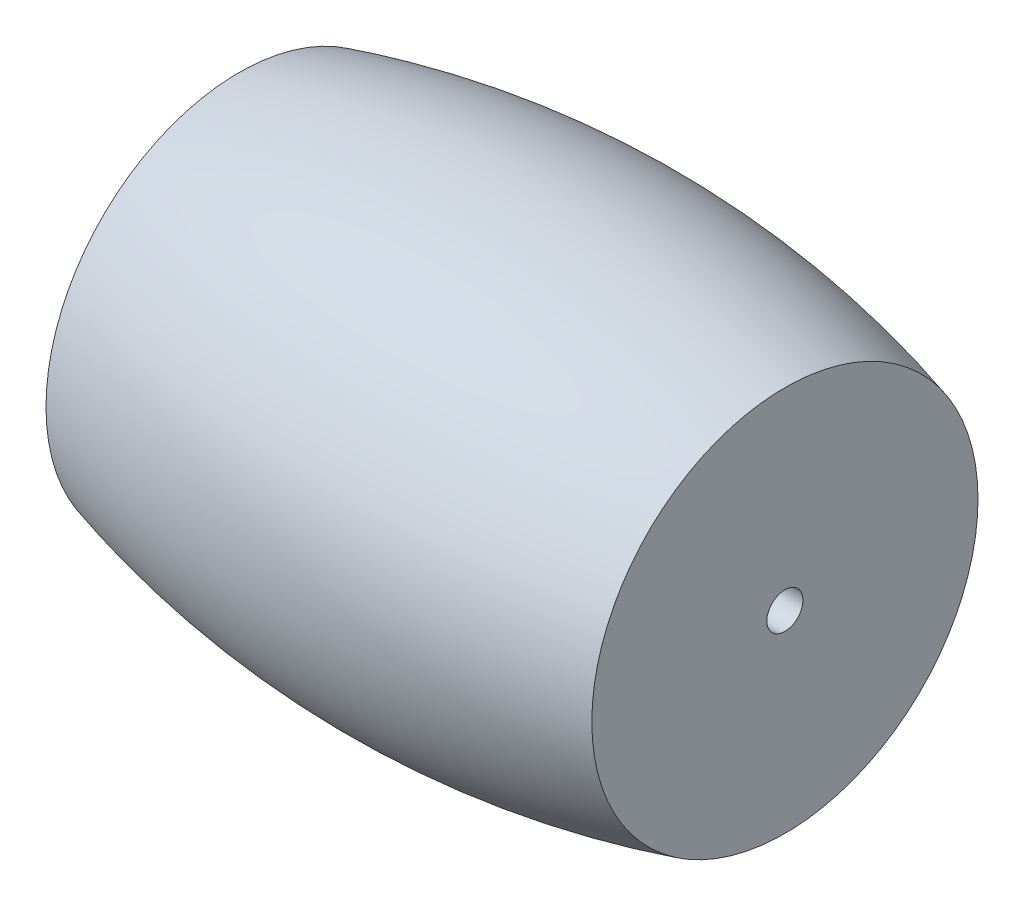
ISO-10303-21;
HEADER;
FILE_DESCRIPTION(('STEP AP214'),'2;1');
FILE_NAME('part.step','',(''),(''),'','','');
FILE_SCHEMA(('AUTOMOTIVE_DESIGN { 1 0 10303 214 1 1 1 1 }'));
ENDSEC;
DATA;
#1=APPLICATION_CONTEXT('core data for automotive mechanical design processes');
#2=APPLICATION_PROTOCOL_DEFINITION('international standard','automotive_design',2000,#1);
#3=PRODUCT_CONTEXT('',#1,'mechanical');
#4=PRODUCT('Part','Part','',(#3));
#5=PRODUCT_RELATED_PRODUCT_CATEGORY('part','',(#4));
#6=PRODUCT_DEFINITION_FORMATION('','',#4);
#7=PRODUCT_DEFINITION_CONTEXT('part definition',#1,'design');
#8=PRODUCT_DEFINITION('design','',#6,#7);
#9=PRODUCT_DEFINITION_SHAPE('','',#8);
#10=(LENGTH_UNIT() NAMED_UNIT(*) SI_UNIT(.MILLI.,.METRE.));
#11=(NAMED_UNIT(*) PLANE_ANGLE_UNIT() SI_UNIT($,.RADIAN.));
#12=(NAMED_UNIT(*) SI_UNIT($,.STERADIAN.) SOLID_ANGLE_UNIT());
#13=UNCERTAINTY_MEASURE_WITH_UNIT(LENGTH_MEASURE(1.E-05),#10,'distance_accuracy_value','');
#14=(GEOMETRIC_REPRESENTATION_CONTEXT(3) GLOBAL_UNCERTAINTY_ASSIGNED_CONTEXT((#13)) GLOBAL_UNIT_ASSIGNED_CONTEXT((#10,
#11,#12)) REPRESENTATION_CONTEXT('',''));
#15=CARTESIAN_POINT('',(0.,0.,0.));
#16=DIRECTION('',(0.,0.,1.));
#17=DIRECTION('',(1.,0.,0.));
#18=AXIS2_PLACEMENT_3D('',#15,#16,#17);
#19=CARTESIAN_POINT('',(17.4164281281047,0.,0.));
#20=DIRECTION('',(1.,0.,0.));
#21=DIRECTION('',(0.,0.,-1.));
#22=AXIS2_PLACEMENT_3D('',#19,#20,#21);
#23=CYLINDRICAL_SURFACE('',#22,1.14999999999999);
#24=CARTESIAN_POINT('',(17.4164281281047,0.,0.));
#25=DIRECTION('',(1.,0.,0.));
#26=DIRECTION('',(0.,0.,-1.));
#27=AXIS2_PLACEMENT_3D('',#24,#25,#26);
#28=CIRCLE('',#27,1.14999999999999);
#29=CARTESIAN_POINT('',(17.4164281281047,0.,-1.14999999999999));
#30=VERTEX_POINT('',#29);
#31=EDGE_CURVE('E10',#30,#30,#28,.T.);
#32=ORIENTED_EDGE('',*,*,#31,.T.);
#33=EDGE_LOOP('',(#32));
#34=FACE_BOUND('',#33,.T.);
#35=CARTESIAN_POINT('',(-17.4164281281047,0.,0.));
#36=DIRECTION('',(1.,0.,0.));
#37=DIRECTION('',(0.,0.,-1.));
#38=AXIS2_PLACEMENT_3D('',#35,#36,#37);
#39=CIRCLE('',#38,1.14999999999999);
#40=CARTESIAN_POINT('',(-17.4164281281047,0.,-1.14999999999999));
#41=VERTEX_POINT('',#40);
#42=EDGE_CURVE('E48',#41,#41,#39,.T.);
#43=ORIENTED_EDGE('',*,*,#42,.F.);
#44=EDGE_LOOP('',(#43));
#45=FACE_BOUND('',#44,.T.);
#46=ADVANCED_FACE('F34',(#34,#45),#23,.F.);
#47=CARTESIAN_POINT('',(17.4164281281047,1.14999999999999,0.));
#48=DIRECTION('',(1.,0.,0.));
#49=DIRECTION('',(0.,0.,-1.));
#50=AXIS2_PLACEMENT_3D('',#47,#48,#49);
#51=PLANE('',#50);
#52=CARTESIAN_POINT('',(17.4164281281047,0.,0.));
#53=DIRECTION('',(1.,0.,0.));
#54=DIRECTION('',(0.,0.,-1.));
#55=AXIS2_PLACEMENT_3D('',#52,#53,#54);
#56=CIRCLE('',#55,12.322080058116);
#57=CARTESIAN_POINT('',(17.4164281281047,0.,-12.322080058116));
#58=VERTEX_POINT('',#57);
#59=EDGE_CURVE('E40',#58,#58,#56,.T.);
#60=ORIENTED_EDGE('',*,*,#59,.T.);
#61=EDGE_LOOP('',(#60));
#62=FACE_BOUND('',#61,.T.);
#63=ORIENTED_EDGE('',*,*,#31,.F.);
#64=EDGE_LOOP('',(#63));
#65=FACE_BOUND('',#64,.T.);
#66=ADVANCED_FACE('F58',(#62,#65),#51,.T.);
#67=CARTESIAN_POINT('',(0.,0.,0.));
#68=DIRECTION('',(1.,0.,0.));
#69=DIRECTION('',(0.,0.,-1.));
#70=AXIS2_PLACEMENT_3D('',#67,#68,#69);
#71=DEGENERATE_TOROIDAL_SURFACE('',#70,49.7820102359908,64.5,.F.);
#72=CARTESIAN_POINT('',(-17.4164281281047,0.,0.));
#73=DIRECTION('',(1.,0.,0.));
#74=DIRECTION('',(0.,0.,-1.));
#75=AXIS2_PLACEMENT_3D('',#72,#73,#74);
#76=CIRCLE('',#75,12.322080058116);
#77=CARTESIAN_POINT('',(-17.4164281281047,0.,-12.322080058116));
#78=VERTEX_POINT('',#77);
#79=EDGE_CURVE('E44',#78,#78,#76,.T.);
#80=ORIENTED_EDGE('',*,*,#79,.T.);
#81=EDGE_LOOP('',(#80));
#82=FACE_BOUND('',#81,.T.);
#83=ORIENTED_EDGE('',*,*,#59,.F.);
#84=EDGE_LOOP('',(#83));
#85=FACE_BOUND('',#84,.T.);
#86=ADVANCED_FACE('F62',(#82,#85),#71,.F.);
#87=CARTESIAN_POINT('',(-17.4164281281047,1.14999999999999,0.));
#88=DIRECTION('',(-1.,0.,0.));
#89=DIRECTION('',(0.,0.,1.));
#90=AXIS2_PLACEMENT_3D('',#87,#88,#89);
#91=PLANE('',#90);
#92=ORIENTED_EDGE('',*,*,#42,.T.);
#93=EDGE_LOOP('',(#92));
#94=FACE_BOUND('',#93,.T.);
#95=ORIENTED_EDGE('',*,*,#79,.F.);
#96=EDGE_LOOP('',(#95));
#97=FACE_BOUND('',#96,.T.);
#98=ADVANCED_FACE('F54',(#94,#97),#91,.T.);
#99=CLOSED_SHELL('',(#46,#66,#86,#98));
#100=MANIFOLD_SOLID_BREP('B2',#99);
#101=ADVANCED_BREP_SHAPE_REPRESENTATION('',(#18,#100),#14);
#102=SHAPE_DEFINITION_REPRESENTATION(#9,#101);
ENDSEC;
END-ISO-10303-21;
